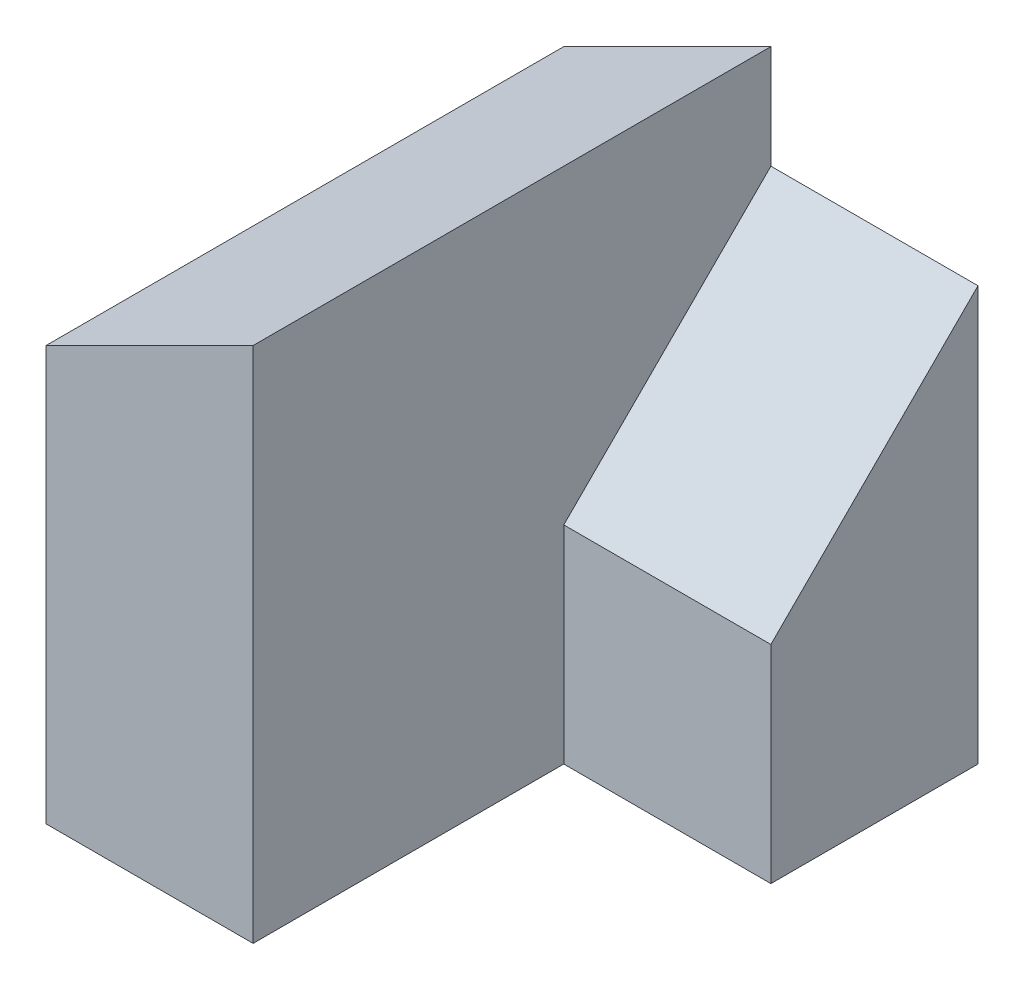
ISO-10303-21;
HEADER;
FILE_DESCRIPTION(('STEP AP214'),'2;1');
FILE_NAME('part.step','',(''),(''),'','','');
FILE_SCHEMA(('AUTOMOTIVE_DESIGN { 1 0 10303 214 1 1 1 1 }'));
ENDSEC;
DATA;
#1=APPLICATION_CONTEXT('core data for automotive mechanical design processes');
#2=APPLICATION_PROTOCOL_DEFINITION('international standard','automotive_design',2000,#1);
#3=PRODUCT_CONTEXT('',#1,'mechanical');
#4=PRODUCT('Part','Part','',(#3));
#5=PRODUCT_RELATED_PRODUCT_CATEGORY('part','',(#4));
#6=PRODUCT_DEFINITION_FORMATION('','',#4);
#7=PRODUCT_DEFINITION_CONTEXT('part definition',#1,'design');
#8=PRODUCT_DEFINITION('design','',#6,#7);
#9=PRODUCT_DEFINITION_SHAPE('','',#8);
#10=(LENGTH_UNIT() NAMED_UNIT(*) SI_UNIT(.MILLI.,.METRE.));
#11=(NAMED_UNIT(*) PLANE_ANGLE_UNIT() SI_UNIT($,.RADIAN.));
#12=(NAMED_UNIT(*) SI_UNIT($,.STERADIAN.) SOLID_ANGLE_UNIT());
#13=UNCERTAINTY_MEASURE_WITH_UNIT(LENGTH_MEASURE(1.E-05),#10,'distance_accuracy_value','');
#14=(GEOMETRIC_REPRESENTATION_CONTEXT(3) GLOBAL_UNCERTAINTY_ASSIGNED_CONTEXT((#13)) GLOBAL_UNIT_ASSIGNED_CONTEXT((#10,
#11,#12)) REPRESENTATION_CONTEXT('',''));
#15=CARTESIAN_POINT('',(0.,0.,0.));
#16=DIRECTION('',(0.,0.,1.));
#17=DIRECTION('',(1.,0.,0.));
#18=AXIS2_PLACEMENT_3D('',#15,#16,#17);
#19=CARTESIAN_POINT('',(0.,0.,25.));
#20=DIRECTION('',(1.,0.,0.));
#21=DIRECTION('',(0.,0.,-1.));
#22=AXIS2_PLACEMENT_3D('',#19,#20,#21);
#23=PLANE('',#22);
#24=DIRECTION('',(0.,0.,-1.));
#25=VECTOR('',#24,1.);
#26=CARTESIAN_POINT('',(0.,10.,0.));
#27=LINE('',#26,#25);
#28=CARTESIAN_POINT('',(0.,10.,15.));
#29=VERTEX_POINT('',#28);
#30=CARTESIAN_POINT('',(0.,10.,0.));
#31=VERTEX_POINT('',#30);
#32=EDGE_CURVE('E137',#29,#31,#27,.T.);
#33=ORIENTED_EDGE('',*,*,#32,.F.);
#34=DIRECTION('',(0.,1.,0.));
#35=VECTOR('',#34,1.);
#36=CARTESIAN_POINT('',(0.,0.,15.));
#37=LINE('',#36,#35);
#38=CARTESIAN_POINT('',(0.,0.,15.));
#39=VERTEX_POINT('',#38);
#40=EDGE_CURVE('E47',#39,#29,#37,.T.);
#41=ORIENTED_EDGE('',*,*,#40,.F.);
#42=DIRECTION('',(0.,0.,-1.));
#43=VECTOR('',#42,1.);
#44=CARTESIAN_POINT('',(0.,0.,25.));
#45=LINE('',#44,#43);
#46=CARTESIAN_POINT('',(0.,0.,25.));
#47=VERTEX_POINT('',#46);
#48=EDGE_CURVE('E40',#47,#39,#45,.T.);
#49=ORIENTED_EDGE('',*,*,#48,.F.);
#50=DIRECTION('',(0.,-1.,0.));
#51=VECTOR('',#50,1.);
#52=CARTESIAN_POINT('',(0.,0.,25.));
#53=LINE('',#52,#51);
#54=CARTESIAN_POINT('',(0.,20.,25.));
#55=VERTEX_POINT('',#54);
#56=EDGE_CURVE('E173',#55,#47,#53,.T.);
#57=ORIENTED_EDGE('',*,*,#56,.F.);
#58=DIRECTION('',(0.,0.,1.));
#59=VECTOR('',#58,1.);
#60=CARTESIAN_POINT('',(0.,20.,-15.));
#61=LINE('',#60,#59);
#62=CARTESIAN_POINT('',(0.,20.,0.));
#63=VERTEX_POINT('',#62);
#64=EDGE_CURVE('E159',#63,#55,#61,.T.);
#65=ORIENTED_EDGE('',*,*,#64,.F.);
#66=DIRECTION('',(0.,-1.,0.));
#67=VECTOR('',#66,1.);
#68=CARTESIAN_POINT('',(0.,0.,0.));
#69=LINE('',#68,#67);
#70=EDGE_CURVE('E53',#63,#31,#69,.T.);
#71=ORIENTED_EDGE('',*,*,#70,.T.);
#72=EDGE_LOOP('',(#33,#41,#49,#57,#65,#71));
#73=FACE_BOUND('',#72,.T.);
#74=ADVANCED_FACE('F33',(#73),#23,.F.);
#75=CARTESIAN_POINT('',(10.,0.,25.));
#76=DIRECTION('',(-1.,0.,0.));
#77=DIRECTION('',(0.,0.,1.));
#78=AXIS2_PLACEMENT_3D('',#75,#76,#77);
#79=PLANE('',#78);
#80=DIRECTION('',(0.,-1.,0.));
#81=VECTOR('',#80,1.);
#82=CARTESIAN_POINT('',(10.,0.,10.));
#83=LINE('',#82,#81);
#84=CARTESIAN_POINT('',(10.,10.,10.));
#85=VERTEX_POINT('',#84);
#86=CARTESIAN_POINT('',(10.,0.,10.));
#87=VERTEX_POINT('',#86);
#88=EDGE_CURVE('E161',#85,#87,#83,.T.);
#89=ORIENTED_EDGE('',*,*,#88,.F.);
#90=DIRECTION('',(0.,0.707106781186548,-0.707106781186547));
#91=VECTOR('',#90,1.);
#92=CARTESIAN_POINT('',(10.,10.,10.));
#93=LINE('',#92,#91);
#94=CARTESIAN_POINT('',(10.,20.,0.));
#95=VERTEX_POINT('',#94);
#96=EDGE_CURVE('E151',#85,#95,#93,.T.);
#97=ORIENTED_EDGE('',*,*,#96,.T.);
#98=DIRECTION('',(0.,1.,0.));
#99=VECTOR('',#98,1.);
#100=CARTESIAN_POINT('',(10.,0.,0.));
#101=LINE('',#100,#99);
#102=CARTESIAN_POINT('',(10.,25.,0.));
#103=VERTEX_POINT('',#102);
#104=EDGE_CURVE('E122',#95,#103,#101,.T.);
#105=ORIENTED_EDGE('',*,*,#104,.T.);
#106=DIRECTION('',(0.,0.,-1.));
#107=VECTOR('',#106,1.);
#108=CARTESIAN_POINT('',(10.,25.,25.));
#109=LINE('',#108,#107);
#110=CARTESIAN_POINT('',(10.,25.,25.));
#111=VERTEX_POINT('',#110);
#112=EDGE_CURVE('E180',#111,#103,#109,.T.);
#113=ORIENTED_EDGE('',*,*,#112,.F.);
#114=DIRECTION('',(0.,1.,0.));
#115=VECTOR('',#114,1.);
#116=CARTESIAN_POINT('',(10.,0.,25.));
#117=LINE('',#116,#115);
#118=CARTESIAN_POINT('',(10.,0.,25.));
#119=VERTEX_POINT('',#118);
#120=EDGE_CURVE('E177',#119,#111,#117,.T.);
#121=ORIENTED_EDGE('',*,*,#120,.F.);
#122=DIRECTION('',(0.,0.,-1.));
#123=VECTOR('',#122,1.);
#124=CARTESIAN_POINT('',(10.,0.,25.));
#125=LINE('',#124,#123);
#126=EDGE_CURVE('E185',#119,#87,#125,.T.);
#127=ORIENTED_EDGE('',*,*,#126,.T.);
#128=EDGE_LOOP('',(#89,#97,#105,#113,#121,#127));
#129=FACE_BOUND('',#128,.T.);
#130=ADVANCED_FACE('F200',(#129),#79,.F.);
#131=CARTESIAN_POINT('',(0.,0.,25.));
#132=DIRECTION('',(0.,1.,0.));
#133=DIRECTION('',(0.,0.,1.));
#134=AXIS2_PLACEMENT_3D('',#131,#132,#133);
#135=PLANE('',#134);
#136=DIRECTION('',(1.,0.,0.));
#137=VECTOR('',#136,1.);
#138=CARTESIAN_POINT('',(0.,0.,0.));
#139=LINE('',#138,#137);
#140=CARTESIAN_POINT('',(-10.,0.,0.));
#141=VERTEX_POINT('',#140);
#142=CARTESIAN_POINT('',(20.,0.,0.));
#143=VERTEX_POINT('',#142);
#144=EDGE_CURVE('E109',#141,#143,#139,.T.);
#145=ORIENTED_EDGE('',*,*,#144,.T.);
#146=DIRECTION('',(0.,0.,-1.));
#147=VECTOR('',#146,1.);
#148=CARTESIAN_POINT('',(20.,0.,0.));
#149=LINE('',#148,#147);
#150=CARTESIAN_POINT('',(20.,0.,10.));
#151=VERTEX_POINT('',#150);
#152=EDGE_CURVE('E165',#151,#143,#149,.T.);
#153=ORIENTED_EDGE('',*,*,#152,.F.);
#154=DIRECTION('',(-1.,0.,0.));
#155=VECTOR('',#154,1.);
#156=CARTESIAN_POINT('',(20.,0.,10.));
#157=LINE('',#156,#155);
#158=EDGE_CURVE('E167',#151,#87,#157,.T.);
#159=ORIENTED_EDGE('',*,*,#158,.T.);
#160=ORIENTED_EDGE('',*,*,#126,.F.);
#161=DIRECTION('',(1.,0.,0.));
#162=VECTOR('',#161,1.);
#163=CARTESIAN_POINT('',(0.,0.,25.));
#164=LINE('',#163,#162);
#165=EDGE_CURVE('E175',#47,#119,#164,.T.);
#166=ORIENTED_EDGE('',*,*,#165,.F.);
#167=ORIENTED_EDGE('',*,*,#48,.T.);
#168=DIRECTION('',(1.,0.,0.));
#169=VECTOR('',#168,1.);
#170=CARTESIAN_POINT('',(-10.,0.,15.));
#171=LINE('',#170,#169);
#172=CARTESIAN_POINT('',(-10.,0.,15.));
#173=VERTEX_POINT('',#172);
#174=EDGE_CURVE('E128',#173,#39,#171,.T.);
#175=ORIENTED_EDGE('',*,*,#174,.F.);
#176=DIRECTION('',(0.,0.,1.));
#177=VECTOR('',#176,1.);
#178=CARTESIAN_POINT('',(-10.,0.,0.));
#179=LINE('',#178,#177);
#180=EDGE_CURVE('E125',#141,#173,#179,.T.);
#181=ORIENTED_EDGE('',*,*,#180,.F.);
#182=EDGE_LOOP('',(#145,#153,#159,#160,#166,#167,#175,#181));
#183=FACE_BOUND('',#182,.T.);
#184=ADVANCED_FACE('F126',(#183),#135,.F.);
#185=CARTESIAN_POINT('',(0.,0.,25.));
#186=DIRECTION('',(0.,0.,-1.));
#187=DIRECTION('',(-1.,0.,0.));
#188=AXIS2_PLACEMENT_3D('',#185,#186,#187);
#189=PLANE('',#188);
#190=ORIENTED_EDGE('',*,*,#120,.T.);
#191=DIRECTION('',(0.894427190999916,0.447213595499958,0.));
#192=VECTOR('',#191,1.);
#193=CARTESIAN_POINT('',(10.,25.,25.));
#194=LINE('',#193,#192);
#195=EDGE_CURVE('E157',#55,#111,#194,.T.);
#196=ORIENTED_EDGE('',*,*,#195,.F.);
#197=ORIENTED_EDGE('',*,*,#56,.T.);
#198=ORIENTED_EDGE('',*,*,#165,.T.);
#199=EDGE_LOOP('',(#190,#196,#197,#198));
#200=FACE_BOUND('',#199,.T.);
#201=ADVANCED_FACE('F214',(#200),#189,.F.);
#202=CARTESIAN_POINT('',(0.,0.,0.));
#203=DIRECTION('',(0.,0.,-1.));
#204=DIRECTION('',(-1.,0.,0.));
#205=AXIS2_PLACEMENT_3D('',#202,#203,#204);
#206=PLANE('',#205);
#207=DIRECTION('',(-0.894427190999916,-0.447213595499958,0.));
#208=VECTOR('',#207,1.);
#209=CARTESIAN_POINT('',(-8.,16.,0.));
#210=LINE('',#209,#208);
#211=EDGE_CURVE('E11',#103,#63,#210,.T.);
#212=ORIENTED_EDGE('',*,*,#211,.F.);
#213=ORIENTED_EDGE('',*,*,#104,.F.);
#214=DIRECTION('',(-1.,0.,0.));
#215=VECTOR('',#214,1.);
#216=CARTESIAN_POINT('',(20.,20.,0.));
#217=LINE('',#216,#215);
#218=CARTESIAN_POINT('',(20.,20.,0.));
#219=VERTEX_POINT('',#218);
#220=EDGE_CURVE('E171',#219,#95,#217,.T.);
#221=ORIENTED_EDGE('',*,*,#220,.F.);
#222=DIRECTION('',(0.,1.,0.));
#223=VECTOR('',#222,1.);
#224=CARTESIAN_POINT('',(20.,0.,0.));
#225=LINE('',#224,#223);
#226=EDGE_CURVE('E118',#143,#219,#225,.T.);
#227=ORIENTED_EDGE('',*,*,#226,.F.);
#228=ORIENTED_EDGE('',*,*,#144,.F.);
#229=DIRECTION('',(0.,-1.,0.));
#230=VECTOR('',#229,1.);
#231=CARTESIAN_POINT('',(-10.,0.,0.));
#232=LINE('',#231,#230);
#233=CARTESIAN_POINT('',(-10.,10.,0.));
#234=VERTEX_POINT('',#233);
#235=EDGE_CURVE('E115',#234,#141,#232,.T.);
#236=ORIENTED_EDGE('',*,*,#235,.F.);
#237=DIRECTION('',(1.,0.,0.));
#238=VECTOR('',#237,1.);
#239=CARTESIAN_POINT('',(-10.,10.,0.));
#240=LINE('',#239,#238);
#241=EDGE_CURVE('E143',#234,#31,#240,.T.);
#242=ORIENTED_EDGE('',*,*,#241,.T.);
#243=ORIENTED_EDGE('',*,*,#70,.F.);
#244=EDGE_LOOP('',(#212,#213,#221,#227,#228,#236,#242,#243));
#245=FACE_BOUND('',#244,.T.);
#246=ADVANCED_FACE('F112',(#245),#206,.T.);
#247=CARTESIAN_POINT('',(20.,0.,10.));
#248=DIRECTION('',(0.,0.,-1.));
#249=DIRECTION('',(0.,1.,0.));
#250=AXIS2_PLACEMENT_3D('',#247,#248,#249);
#251=PLANE('',#250);
#252=DIRECTION('',(0.,-1.,0.));
#253=VECTOR('',#252,1.);
#254=CARTESIAN_POINT('',(20.,0.,10.));
#255=LINE('',#254,#253);
#256=CARTESIAN_POINT('',(20.,10.,10.));
#257=VERTEX_POINT('',#256);
#258=EDGE_CURVE('E163',#257,#151,#255,.T.);
#259=ORIENTED_EDGE('',*,*,#258,.F.);
#260=DIRECTION('',(1.,0.,0.));
#261=VECTOR('',#260,1.);
#262=CARTESIAN_POINT('',(10.,10.,10.));
#263=LINE('',#262,#261);
#264=EDGE_CURVE('E154',#85,#257,#263,.T.);
#265=ORIENTED_EDGE('',*,*,#264,.F.);
#266=ORIENTED_EDGE('',*,*,#88,.T.);
#267=ORIENTED_EDGE('',*,*,#158,.F.);
#268=EDGE_LOOP('',(#259,#265,#266,#267));
#269=FACE_BOUND('',#268,.T.);
#270=ADVANCED_FACE('F208',(#269),#251,.F.);
#271=CARTESIAN_POINT('',(20.,0.,0.));
#272=DIRECTION('',(1.,0.,0.));
#273=DIRECTION('',(0.,0.,-1.));
#274=AXIS2_PLACEMENT_3D('',#271,#272,#273);
#275=PLANE('',#274);
#276=DIRECTION('',(0.,0.707106781186548,-0.707106781186547));
#277=VECTOR('',#276,1.);
#278=CARTESIAN_POINT('',(20.,10.,10.));
#279=LINE('',#278,#277);
#280=EDGE_CURVE('E150',#257,#219,#279,.T.);
#281=ORIENTED_EDGE('',*,*,#280,.F.);
#282=ORIENTED_EDGE('',*,*,#258,.T.);
#283=ORIENTED_EDGE('',*,*,#152,.T.);
#284=ORIENTED_EDGE('',*,*,#226,.T.);
#285=EDGE_LOOP('',(#281,#282,#283,#284));
#286=FACE_BOUND('',#285,.T.);
#287=ADVANCED_FACE('F211',(#286),#275,.T.);
#288=CARTESIAN_POINT('',(10.,25.,-15.));
#289=DIRECTION('',(0.447213595499958,-0.894427190999916,0.));
#290=DIRECTION('',(0.894427190999916,0.447213595499958,0.));
#291=AXIS2_PLACEMENT_3D('',#288,#289,#290);
#292=PLANE('',#291);
#293=ORIENTED_EDGE('',*,*,#211,.T.);
#294=ORIENTED_EDGE('',*,*,#64,.T.);
#295=ORIENTED_EDGE('',*,*,#195,.T.);
#296=ORIENTED_EDGE('',*,*,#112,.T.);
#297=EDGE_LOOP('',(#293,#294,#295,#296));
#298=FACE_BOUND('',#297,.T.);
#299=ADVANCED_FACE('F215',(#298),#292,.F.);
#300=CARTESIAN_POINT('',(10.,10.,10.));
#301=DIRECTION('',(0.,-0.707106781186547,-0.707106781186548));
#302=DIRECTION('',(0.,0.707106781186548,-0.707106781186547));
#303=AXIS2_PLACEMENT_3D('',#300,#301,#302);
#304=PLANE('',#303);
#305=ORIENTED_EDGE('',*,*,#280,.T.);
#306=ORIENTED_EDGE('',*,*,#220,.T.);
#307=ORIENTED_EDGE('',*,*,#96,.F.);
#308=ORIENTED_EDGE('',*,*,#264,.T.);
#309=EDGE_LOOP('',(#305,#306,#307,#308));
#310=FACE_BOUND('',#309,.T.);
#311=ADVANCED_FACE('F204',(#310),#304,.F.);
#312=CARTESIAN_POINT('',(-10.,0.,15.));
#313=DIRECTION('',(0.,0.,-1.));
#314=DIRECTION('',(-1.,0.,0.));
#315=AXIS2_PLACEMENT_3D('',#312,#313,#314);
#316=PLANE('',#315);
#317=ORIENTED_EDGE('',*,*,#40,.T.);
#318=DIRECTION('',(1.,0.,0.));
#319=VECTOR('',#318,1.);
#320=CARTESIAN_POINT('',(-10.,10.,15.));
#321=LINE('',#320,#319);
#322=CARTESIAN_POINT('',(-10.,10.,15.));
#323=VERTEX_POINT('',#322);
#324=EDGE_CURVE('E146',#323,#29,#321,.T.);
#325=ORIENTED_EDGE('',*,*,#324,.F.);
#326=DIRECTION('',(0.,1.,0.));
#327=VECTOR('',#326,1.);
#328=CARTESIAN_POINT('',(-10.,0.,15.));
#329=LINE('',#328,#327);
#330=EDGE_CURVE('E131',#173,#323,#329,.T.);
#331=ORIENTED_EDGE('',*,*,#330,.F.);
#332=ORIENTED_EDGE('',*,*,#174,.T.);
#333=EDGE_LOOP('',(#317,#325,#331,#332));
#334=FACE_BOUND('',#333,.T.);
#335=ADVANCED_FACE('F191',(#334),#316,.F.);
#336=CARTESIAN_POINT('',(-10.,10.,0.));
#337=DIRECTION('',(0.,-1.,0.));
#338=DIRECTION('',(0.,0.,-1.));
#339=AXIS2_PLACEMENT_3D('',#336,#337,#338);
#340=PLANE('',#339);
#341=ORIENTED_EDGE('',*,*,#32,.T.);
#342=ORIENTED_EDGE('',*,*,#241,.F.);
#343=DIRECTION('',(0.,0.,-1.));
#344=VECTOR('',#343,1.);
#345=CARTESIAN_POINT('',(-10.,10.,0.));
#346=LINE('',#345,#344);
#347=EDGE_CURVE('E135',#323,#234,#346,.T.);
#348=ORIENTED_EDGE('',*,*,#347,.F.);
#349=ORIENTED_EDGE('',*,*,#324,.T.);
#350=EDGE_LOOP('',(#341,#342,#348,#349));
#351=FACE_BOUND('',#350,.T.);
#352=ADVANCED_FACE('F194',(#351),#340,.F.);
#353=CARTESIAN_POINT('',(-10.,0.,0.));
#354=DIRECTION('',(1.,0.,0.));
#355=DIRECTION('',(0.,0.,-1.));
#356=AXIS2_PLACEMENT_3D('',#353,#354,#355);
#357=PLANE('',#356);
#358=ORIENTED_EDGE('',*,*,#235,.T.);
#359=ORIENTED_EDGE('',*,*,#180,.T.);
#360=ORIENTED_EDGE('',*,*,#330,.T.);
#361=ORIENTED_EDGE('',*,*,#347,.T.);
#362=EDGE_LOOP('',(#358,#359,#360,#361));
#363=FACE_BOUND('',#362,.T.);
#364=ADVANCED_FACE('F133',(#363),#357,.F.);
#365=CLOSED_SHELL('',(#74,#130,#184,#201,#246,#270,#287,#299,#311,#335,#352,#364));
#366=MANIFOLD_SOLID_BREP('B2',#365);
#367=ADVANCED_BREP_SHAPE_REPRESENTATION('',(#18,#366),#14);
#368=SHAPE_DEFINITION_REPRESENTATION(#9,#367);
ENDSEC;
END-ISO-10303-21;
